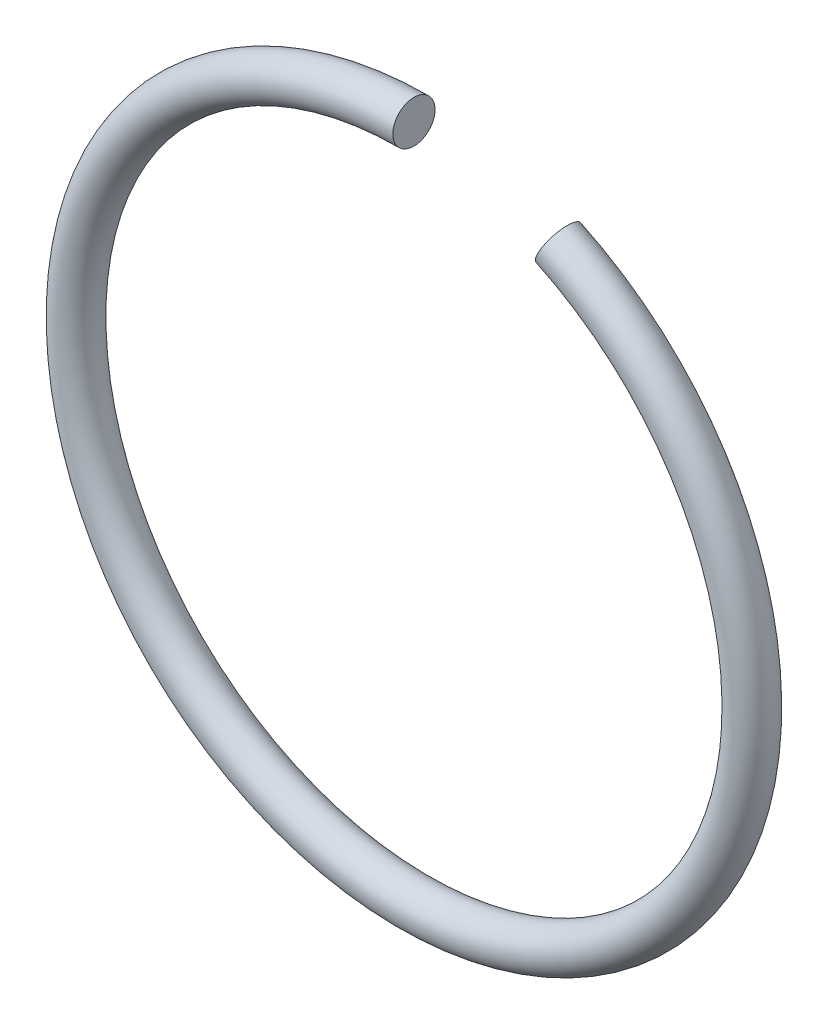
ISO-10303-21;
HEADER;
FILE_DESCRIPTION(('STEP AP214'),'2;1');
FILE_NAME('part.step','',(''),(''),'','','');
FILE_SCHEMA(('AUTOMOTIVE_DESIGN { 1 0 10303 214 1 1 1 1 }'));
ENDSEC;
DATA;
#1=APPLICATION_CONTEXT('core data for automotive mechanical design processes');
#2=APPLICATION_PROTOCOL_DEFINITION('international standard','automotive_design',2000,#1);
#3=PRODUCT_CONTEXT('',#1,'mechanical');
#4=PRODUCT('Part','Part','',(#3));
#5=PRODUCT_RELATED_PRODUCT_CATEGORY('part','',(#4));
#6=PRODUCT_DEFINITION_FORMATION('','',#4);
#7=PRODUCT_DEFINITION_CONTEXT('part definition',#1,'design');
#8=PRODUCT_DEFINITION('design','',#6,#7);
#9=PRODUCT_DEFINITION_SHAPE('','',#8);
#10=(LENGTH_UNIT() NAMED_UNIT(*) SI_UNIT(.MILLI.,.METRE.));
#11=(NAMED_UNIT(*) PLANE_ANGLE_UNIT() SI_UNIT($,.RADIAN.));
#12=(NAMED_UNIT(*) SI_UNIT($,.STERADIAN.) SOLID_ANGLE_UNIT());
#13=UNCERTAINTY_MEASURE_WITH_UNIT(LENGTH_MEASURE(1.E-05),#10,'distance_accuracy_value','');
#14=(GEOMETRIC_REPRESENTATION_CONTEXT(3) GLOBAL_UNCERTAINTY_ASSIGNED_CONTEXT((#13)) GLOBAL_UNIT_ASSIGNED_CONTEXT((#10,
#11,#12)) REPRESENTATION_CONTEXT('',''));
#15=CARTESIAN_POINT('',(0.,0.,0.));
#16=DIRECTION('',(0.,0.,1.));
#17=DIRECTION('',(1.,0.,0.));
#18=AXIS2_PLACEMENT_3D('',#15,#16,#17);
#19=CARTESIAN_POINT('',(0.,8.,0.));
#20=DIRECTION('',(1.,0.,0.));
#21=DIRECTION('',(0.,0.,-1.));
#22=AXIS2_PLACEMENT_3D('',#19,#20,#21);
#23=PLANE('',#22);
#24=CARTESIAN_POINT('',(0.,8.,0.));
#25=DIRECTION('',(1.,0.,0.));
#26=DIRECTION('',(0.,0.,-1.));
#27=AXIS2_PLACEMENT_3D('',#24,#25,#26);
#28=CIRCLE('',#27,0.5);
#29=CARTESIAN_POINT('',(0.,8.5,0.));
#30=VERTEX_POINT('',#29);
#31=EDGE_CURVE('E37',#30,#30,#28,.T.);
#32=ORIENTED_EDGE('',*,*,#31,.T.);
#33=EDGE_LOOP('',(#32));
#34=FACE_BOUND('',#33,.T.);
#35=ADVANCED_FACE('F31',(#34),#23,.T.);
#36=CARTESIAN_POINT('',(3.41523328037412,7.234375,0.));
#37=DIRECTION('',(0.904296875,-0.426904160046765,0.));
#38=DIRECTION('',(0.,0.,-1.));
#39=AXIS2_PLACEMENT_3D('',#36,#37,#38);
#40=PLANE('',#39);
#41=CARTESIAN_POINT('',(3.41523328037412,7.234375,0.));
#42=DIRECTION('',(0.904296875,-0.426904160046765,0.));
#43=DIRECTION('',(0.,0.,-1.));
#44=AXIS2_PLACEMENT_3D('',#41,#42,#43);
#45=CIRCLE('',#44,0.5);
#46=CARTESIAN_POINT('',(3.6286853603975,7.6865234375,0.));
#47=VERTEX_POINT('',#46);
#48=EDGE_CURVE('E10',#47,#47,#45,.T.);
#49=ORIENTED_EDGE('',*,*,#48,.F.);
#50=EDGE_LOOP('',(#49));
#51=FACE_BOUND('',#50,.T.);
#52=ADVANCED_FACE('F46',(#51),#40,.F.);
#53=CARTESIAN_POINT('',(0.,0.,0.));
#54=DIRECTION('',(0.,0.,1.));
#55=DIRECTION('',(1.,0.,0.));
#56=AXIS2_PLACEMENT_3D('',#53,#54,#55);
#57=TOROIDAL_SURFACE('',#56,8.,0.5);
#58=CARTESIAN_POINT('',(0.,0.,0.));
#59=DIRECTION('',(0.,0.,1.));
#60=DIRECTION('',(1.,0.,0.));
#61=AXIS2_PLACEMENT_3D('',#58,#59,#60);
#62=CIRCLE('',#61,8.5);
#63=EDGE_CURVE('',#30,#47,#62,.T.);
#64=ORIENTED_EDGE('',*,*,#31,.F.);
#65=ORIENTED_EDGE('',*,*,#48,.T.);
#66=ORIENTED_EDGE('',*,*,#63,.T.);
#67=ORIENTED_EDGE('',*,*,#63,.F.);
#68=EDGE_LOOP('',(#64,#66,#65,#67));
#69=FACE_BOUND('',#68,.T.);
#70=ADVANCED_FACE('F44',(#69),#57,.T.);
#71=CLOSED_SHELL('',(#35,#52,#70));
#72=MANIFOLD_SOLID_BREP('B2',#71);
#73=ADVANCED_BREP_SHAPE_REPRESENTATION('',(#18,#72),#14);
#74=SHAPE_DEFINITION_REPRESENTATION(#9,#73);
ENDSEC;
END-ISO-10303-21;
